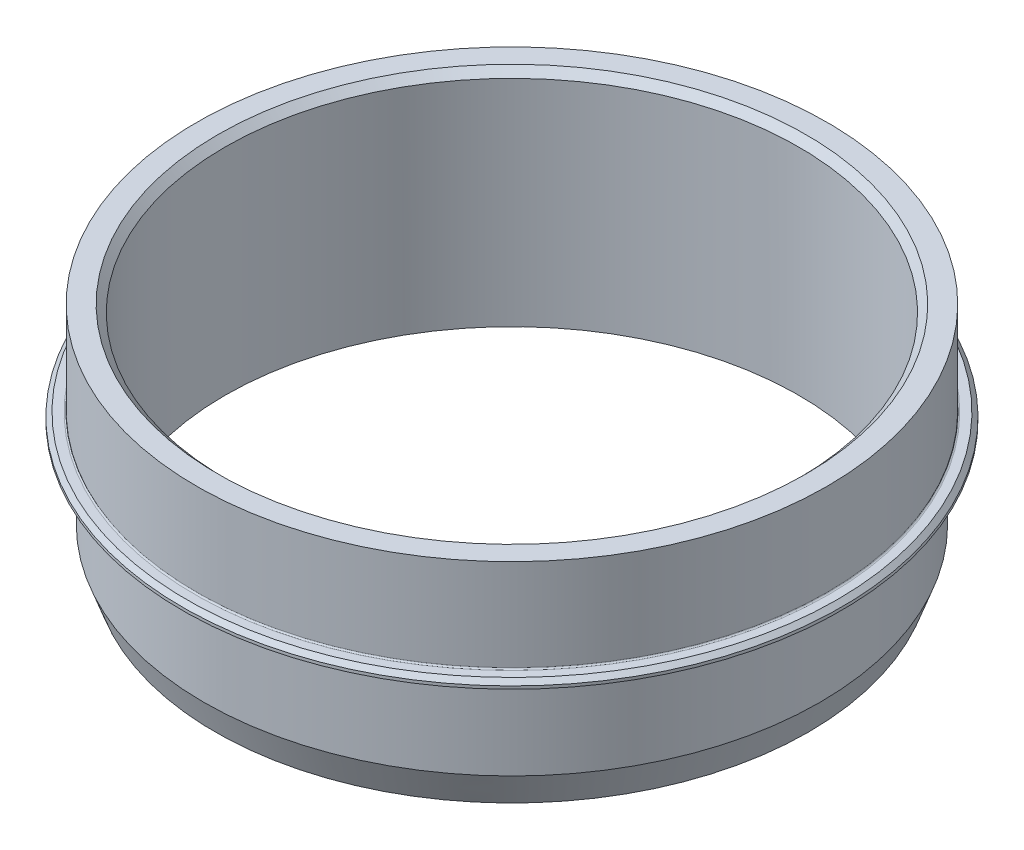
ISO-10303-21;
HEADER;
FILE_DESCRIPTION(('STEP AP214'),'2;1');
FILE_NAME('part.step','',(''),(''),'','','');
FILE_SCHEMA(('AUTOMOTIVE_DESIGN { 1 0 10303 214 1 1 1 1 }'));
ENDSEC;
DATA;
#1=APPLICATION_CONTEXT('core data for automotive mechanical design processes');
#2=APPLICATION_PROTOCOL_DEFINITION('international standard','automotive_design',2000,#1);
#3=PRODUCT_CONTEXT('',#1,'mechanical');
#4=PRODUCT('Part','Part','',(#3));
#5=PRODUCT_RELATED_PRODUCT_CATEGORY('part','',(#4));
#6=PRODUCT_DEFINITION_FORMATION('','',#4);
#7=PRODUCT_DEFINITION_CONTEXT('part definition',#1,'design');
#8=PRODUCT_DEFINITION('design','',#6,#7);
#9=PRODUCT_DEFINITION_SHAPE('','',#8);
#10=(LENGTH_UNIT() NAMED_UNIT(*) SI_UNIT(.MILLI.,.METRE.));
#11=(NAMED_UNIT(*) PLANE_ANGLE_UNIT() SI_UNIT($,.RADIAN.));
#12=(NAMED_UNIT(*) SI_UNIT($,.STERADIAN.) SOLID_ANGLE_UNIT());
#13=UNCERTAINTY_MEASURE_WITH_UNIT(LENGTH_MEASURE(1.E-05),#10,'distance_accuracy_value','');
#14=(GEOMETRIC_REPRESENTATION_CONTEXT(3) GLOBAL_UNCERTAINTY_ASSIGNED_CONTEXT((#13)) GLOBAL_UNIT_ASSIGNED_CONTEXT((#10,
#11,#12)) REPRESENTATION_CONTEXT('',''));
#15=CARTESIAN_POINT('',(0.,0.,0.));
#16=DIRECTION('',(0.,0.,1.));
#17=DIRECTION('',(1.,0.,0.));
#18=AXIS2_PLACEMENT_3D('',#15,#16,#17);
#19=CARTESIAN_POINT('',(0.,-20.75,238.82));
#20=DIRECTION('',(0.,1.,0.));
#21=DIRECTION('',(-1.,0.,0.));
#22=AXIS2_PLACEMENT_3D('',#19,#20,#21);
#23=PLANE('',#22);
#24=CARTESIAN_POINT('',(0.,-20.75,284.8));
#25=DIRECTION('',(0.,-1.,0.));
#26=DIRECTION('',(1.,0.,0.));
#27=AXIS2_PLACEMENT_3D('',#24,#25,#26);
#28=CIRCLE('',#27,44.18);
#29=CARTESIAN_POINT('',(44.18,-20.75,284.8));
#30=VERTEX_POINT('',#29);
#31=EDGE_CURVE('E104',#30,#30,#28,.T.);
#32=ORIENTED_EDGE('',*,*,#31,.T.);
#33=EDGE_LOOP('',(#32));
#34=FACE_BOUND('',#33,.T.);
#35=CARTESIAN_POINT('',(0.,-20.75,284.8));
#36=DIRECTION('',(0.,1.,0.));
#37=DIRECTION('',(1.,0.,0.));
#38=AXIS2_PLACEMENT_3D('',#35,#36,#37);
#39=CIRCLE('',#38,45.38);
#40=CARTESIAN_POINT('',(-45.38,-20.75,284.8));
#41=VERTEX_POINT('',#40);
#42=EDGE_CURVE('E74',#41,#41,#39,.T.);
#43=ORIENTED_EDGE('',*,*,#42,.T.);
#44=EDGE_LOOP('',(#43));
#45=FACE_BOUND('',#44,.T.);
#46=ADVANCED_FACE('F17',(#34,#45),#23,.T.);
#47=CARTESIAN_POINT('',(0.,-21.75,241.82));
#48=DIRECTION('',(0.,-1.,0.));
#49=DIRECTION('',(0.,0.,1.));
#50=AXIS2_PLACEMENT_3D('',#47,#48,#49);
#51=PLANE('',#50);
#52=CARTESIAN_POINT('',(0.,-21.75,284.8));
#53=DIRECTION('',(0.,-1.,0.));
#54=DIRECTION('',(-1.,0.,0.));
#55=AXIS2_PLACEMENT_3D('',#52,#53,#54);
#56=CIRCLE('',#55,42.98);
#57=CARTESIAN_POINT('',(42.98,-21.75,284.8));
#58=VERTEX_POINT('',#57);
#59=EDGE_CURVE('E27',#58,#58,#56,.T.);
#60=ORIENTED_EDGE('',*,*,#59,.F.);
#61=EDGE_LOOP('',(#60));
#62=FACE_BOUND('',#61,.T.);
#63=CARTESIAN_POINT('',(0.,-21.75,284.8));
#64=DIRECTION('',(0.,-1.,0.));
#65=DIRECTION('',(-1.,0.,0.));
#66=AXIS2_PLACEMENT_3D('',#63,#64,#65);
#67=CIRCLE('',#66,45.98);
#68=CARTESIAN_POINT('',(-45.98,-21.75,284.8));
#69=VERTEX_POINT('',#68);
#70=EDGE_CURVE('E90',#69,#69,#67,.T.);
#71=ORIENTED_EDGE('',*,*,#70,.T.);
#72=EDGE_LOOP('',(#71));
#73=FACE_BOUND('',#72,.T.);
#74=ADVANCED_FACE('F91',(#62,#73),#51,.T.);
#75=CARTESIAN_POINT('',(0.,-38.75,244.78));
#76=DIRECTION('',(0.,-1.,0.));
#77=DIRECTION('',(0.,0.,1.));
#78=AXIS2_PLACEMENT_3D('',#75,#76,#77);
#79=PLANE('',#78);
#80=CARTESIAN_POINT('',(0.,-38.75,284.8));
#81=DIRECTION('',(0.,-1.,0.));
#82=DIRECTION('',(-1.,0.,0.));
#83=AXIS2_PLACEMENT_3D('',#80,#81,#82);
#84=CIRCLE('',#83,40.02);
#85=CARTESIAN_POINT('',(-40.02,-38.75,284.8));
#86=VERTEX_POINT('',#85);
#87=EDGE_CURVE('E11',#86,#86,#84,.T.);
#88=ORIENTED_EDGE('',*,*,#87,.F.);
#89=EDGE_LOOP('',(#88));
#90=FACE_BOUND('',#89,.T.);
#91=CARTESIAN_POINT('',(0.,-38.75,284.8));
#92=DIRECTION('',(0.,-1.,0.));
#93=DIRECTION('',(-1.,0.,0.));
#94=AXIS2_PLACEMENT_3D('',#91,#92,#93);
#95=CIRCLE('',#94,41.38);
#96=CARTESIAN_POINT('',(41.38,-38.75,284.8));
#97=VERTEX_POINT('',#96);
#98=EDGE_CURVE('E120',#97,#97,#95,.T.);
#99=ORIENTED_EDGE('',*,*,#98,.T.);
#100=EDGE_LOOP('',(#99));
#101=FACE_BOUND('',#100,.T.);
#102=ADVANCED_FACE('F147',(#90,#101),#79,.T.);
#103=CARTESIAN_POINT('',(0.,-7.75,240.82));
#104=DIRECTION('',(0.,1.,0.));
#105=DIRECTION('',(-1.,0.,0.));
#106=AXIS2_PLACEMENT_3D('',#103,#104,#105);
#107=PLANE('',#106);
#108=CARTESIAN_POINT('',(0.,-7.75,284.8));
#109=DIRECTION('',(0.,-1.,0.));
#110=DIRECTION('',(1.,0.,0.));
#111=AXIS2_PLACEMENT_3D('',#108,#109,#110);
#112=CIRCLE('',#111,41.02);
#113=CARTESIAN_POINT('',(41.02,-7.75,284.8));
#114=VERTEX_POINT('',#113);
#115=EDGE_CURVE('E112',#114,#114,#112,.T.);
#116=ORIENTED_EDGE('',*,*,#115,.T.);
#117=EDGE_LOOP('',(#116));
#118=FACE_BOUND('',#117,.T.);
#119=CARTESIAN_POINT('',(0.,-7.75,284.8));
#120=DIRECTION('',(0.,-1.,0.));
#121=DIRECTION('',(-1.,0.,0.));
#122=AXIS2_PLACEMENT_3D('',#119,#120,#121);
#123=CIRCLE('',#122,43.98);
#124=CARTESIAN_POINT('',(43.98,-7.75,284.8));
#125=VERTEX_POINT('',#124);
#126=EDGE_CURVE('E94',#125,#125,#123,.T.);
#127=ORIENTED_EDGE('',*,*,#126,.F.);
#128=EDGE_LOOP('',(#127));
#129=FACE_BOUND('',#128,.T.);
#130=ADVANCED_FACE('F127',(#118,#129),#107,.T.);
#131=CARTESIAN_POINT('',(0.,-7.75,284.8));
#132=DIRECTION('',(0.,-1.,0.));
#133=DIRECTION('',(-1.,0.,0.));
#134=AXIS2_PLACEMENT_3D('',#131,#132,#133);
#135=CYLINDRICAL_SURFACE('',#134,40.02);
#136=ORIENTED_EDGE('',*,*,#87,.T.);
#137=EDGE_LOOP('',(#136));
#138=FACE_BOUND('',#137,.T.);
#139=CARTESIAN_POINT('',(0.,-8.75,284.8));
#140=DIRECTION('',(0.,1.,0.));
#141=DIRECTION('',(1.,0.,0.));
#142=AXIS2_PLACEMENT_3D('',#139,#140,#141);
#143=CIRCLE('',#142,40.02);
#144=CARTESIAN_POINT('',(40.02,-8.75,284.8));
#145=VERTEX_POINT('',#144);
#146=EDGE_CURVE('E109',#145,#145,#143,.T.);
#147=ORIENTED_EDGE('',*,*,#146,.T.);
#148=EDGE_LOOP('',(#147));
#149=FACE_BOUND('',#148,.T.);
#150=ADVANCED_FACE('F137',(#138,#149),#135,.F.);
#151=CARTESIAN_POINT('',(0.,-7.75,284.8));
#152=DIRECTION('',(0.,-1.,0.));
#153=DIRECTION('',(-1.,0.,0.));
#154=AXIS2_PLACEMENT_3D('',#151,#152,#153);
#155=CYLINDRICAL_SURFACE('',#154,42.98);
#156=CARTESIAN_POINT('',(0.,-34.3540361288726,284.8));
#157=DIRECTION('',(0.,1.,0.));
#158=DIRECTION('',(-1.,0.,0.));
#159=AXIS2_PLACEMENT_3D('',#156,#157,#158);
#160=CIRCLE('',#159,42.98);
#161=CARTESIAN_POINT('',(42.98,-34.3540361288726,284.8));
#162=VERTEX_POINT('',#161);
#163=EDGE_CURVE('E119',#162,#162,#160,.T.);
#164=ORIENTED_EDGE('',*,*,#163,.T.);
#165=EDGE_LOOP('',(#164));
#166=FACE_BOUND('',#165,.T.);
#167=ORIENTED_EDGE('',*,*,#59,.T.);
#168=EDGE_LOOP('',(#167));
#169=FACE_BOUND('',#168,.T.);
#170=ADVANCED_FACE('F19',(#166,#169),#155,.T.);
#171=CARTESIAN_POINT('',(0.,-7.75,284.8));
#172=DIRECTION('',(0.,-1.,0.));
#173=DIRECTION('',(-1.,0.,0.));
#174=AXIS2_PLACEMENT_3D('',#171,#172,#173);
#175=CYLINDRICAL_SURFACE('',#174,45.98);
#176=ORIENTED_EDGE('',*,*,#70,.F.);
#177=EDGE_LOOP('',(#176));
#178=FACE_BOUND('',#177,.T.);
#179=CARTESIAN_POINT('',(0.,-21.35,284.8));
#180=DIRECTION('',(0.,-1.,0.));
#181=DIRECTION('',(1.,0.,0.));
#182=AXIS2_PLACEMENT_3D('',#179,#180,#181);
#183=CIRCLE('',#182,45.98);
#184=CARTESIAN_POINT('',(-45.98,-21.35,284.8));
#185=VERTEX_POINT('',#184);
#186=EDGE_CURVE('E62',#185,#185,#183,.T.);
#187=ORIENTED_EDGE('',*,*,#186,.T.);
#188=EDGE_LOOP('',(#187));
#189=FACE_BOUND('',#188,.T.);
#190=ADVANCED_FACE('F145',(#178,#189),#175,.T.);
#191=CARTESIAN_POINT('',(0.,-7.75,284.8));
#192=DIRECTION('',(0.,-1.,0.));
#193=DIRECTION('',(-1.,0.,0.));
#194=AXIS2_PLACEMENT_3D('',#191,#192,#193);
#195=CYLINDRICAL_SURFACE('',#194,43.98);
#196=CARTESIAN_POINT('',(0.,-20.55,284.8));
#197=DIRECTION('',(0.,1.,0.));
#198=DIRECTION('',(1.,0.,0.));
#199=AXIS2_PLACEMENT_3D('',#196,#197,#198);
#200=CIRCLE('',#199,43.98);
#201=CARTESIAN_POINT('',(43.98,-20.55,284.8));
#202=VERTEX_POINT('',#201);
#203=EDGE_CURVE('E115',#202,#202,#200,.T.);
#204=ORIENTED_EDGE('',*,*,#203,.T.);
#205=EDGE_LOOP('',(#204));
#206=FACE_BOUND('',#205,.T.);
#207=ORIENTED_EDGE('',*,*,#126,.T.);
#208=EDGE_LOOP('',(#207));
#209=FACE_BOUND('',#208,.T.);
#210=ADVANCED_FACE('F165',(#206,#209),#195,.T.);
#211=CARTESIAN_POINT('',(0.,-21.35,284.8));
#212=DIRECTION('',(0.,-1.,0.));
#213=DIRECTION('',(-1.,0.,0.));
#214=AXIS2_PLACEMENT_3D('',#211,#212,#213);
#215=CONICAL_SURFACE('',#214,45.98,0.785398163397448);
#216=ORIENTED_EDGE('',*,*,#186,.F.);
#217=EDGE_LOOP('',(#216));
#218=FACE_BOUND('',#217,.T.);
#219=ORIENTED_EDGE('',*,*,#42,.F.);
#220=EDGE_LOOP('',(#219));
#221=FACE_BOUND('',#220,.T.);
#222=ADVANCED_FACE('F162',(#218,#221),#215,.T.);
#223=CARTESIAN_POINT('',(0.,-20.55,284.8));
#224=DIRECTION('',(0.,1.,0.));
#225=DIRECTION('',(1.,0.,0.));
#226=AXIS2_PLACEMENT_3D('',#223,#224,#225);
#227=TOROIDAL_SURFACE('',#226,44.18,0.2);
#228=ORIENTED_EDGE('',*,*,#31,.F.);
#229=EDGE_LOOP('',(#228));
#230=FACE_BOUND('',#229,.T.);
#231=ORIENTED_EDGE('',*,*,#203,.F.);
#232=EDGE_LOOP('',(#231));
#233=FACE_BOUND('',#232,.T.);
#234=ADVANCED_FACE('F160',(#230,#233),#227,.F.);
#235=CARTESIAN_POINT('',(0.,-38.75,284.8));
#236=DIRECTION('',(0.,1.,0.));
#237=DIRECTION('',(1.,0.,0.));
#238=AXIS2_PLACEMENT_3D('',#235,#236,#237);
#239=CONICAL_SURFACE('',#238,41.38,0.349065850398867);
#240=ORIENTED_EDGE('',*,*,#163,.F.);
#241=EDGE_LOOP('',(#240));
#242=FACE_BOUND('',#241,.T.);
#243=ORIENTED_EDGE('',*,*,#98,.F.);
#244=EDGE_LOOP('',(#243));
#245=FACE_BOUND('',#244,.T.);
#246=ADVANCED_FACE('F133',(#242,#245),#239,.T.);
#247=CARTESIAN_POINT('',(0.,-7.75,284.8));
#248=DIRECTION('',(0.,1.,0.));
#249=DIRECTION('',(1.,0.,0.));
#250=AXIS2_PLACEMENT_3D('',#247,#248,#249);
#251=CONICAL_SURFACE('',#250,41.02,0.785398163397438);
#252=ORIENTED_EDGE('',*,*,#115,.F.);
#253=EDGE_LOOP('',(#252));
#254=FACE_BOUND('',#253,.T.);
#255=ORIENTED_EDGE('',*,*,#146,.F.);
#256=EDGE_LOOP('',(#255));
#257=FACE_BOUND('',#256,.T.);
#258=ADVANCED_FACE('F130',(#254,#257),#251,.F.);
#259=CLOSED_SHELL('',(#46,#74,#102,#130,#150,#170,#190,#210,#222,#234,#246,#258));
#260=MANIFOLD_SOLID_BREP('B1',#259);
#261=ADVANCED_BREP_SHAPE_REPRESENTATION('',(#18,#260),#14);
#262=SHAPE_DEFINITION_REPRESENTATION(#9,#261);
ENDSEC;
END-ISO-10303-21;
